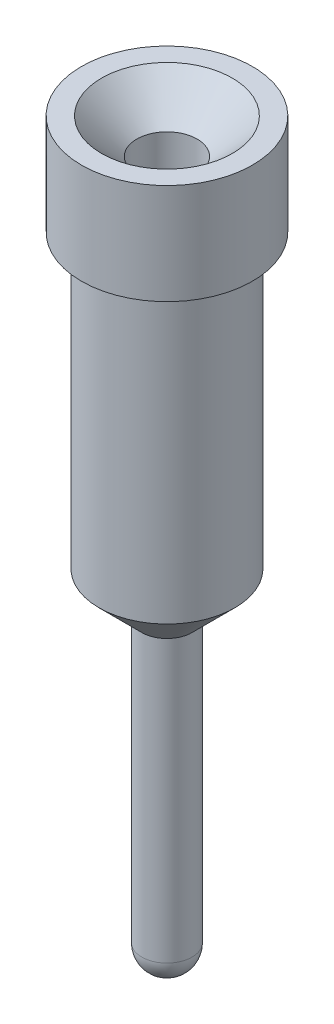
ISO-10303-21;
HEADER;
FILE_DESCRIPTION(('STEP AP214'),'2;1');
FILE_NAME('part.step','',(''),(''),'','','');
FILE_SCHEMA(('AUTOMOTIVE_DESIGN { 1 0 10303 214 1 1 1 1 }'));
ENDSEC;
DATA;
#1=APPLICATION_CONTEXT('core data for automotive mechanical design processes');
#2=APPLICATION_PROTOCOL_DEFINITION('international standard','automotive_design',2000,#1);
#3=PRODUCT_CONTEXT('',#1,'mechanical');
#4=PRODUCT('Part','Part','',(#3));
#5=PRODUCT_RELATED_PRODUCT_CATEGORY('part','',(#4));
#6=PRODUCT_DEFINITION_FORMATION('','',#4);
#7=PRODUCT_DEFINITION_CONTEXT('part definition',#1,'design');
#8=PRODUCT_DEFINITION('design','',#6,#7);
#9=PRODUCT_DEFINITION_SHAPE('','',#8);
#10=(LENGTH_UNIT() NAMED_UNIT(*) SI_UNIT(.MILLI.,.METRE.));
#11=(NAMED_UNIT(*) PLANE_ANGLE_UNIT() SI_UNIT($,.RADIAN.));
#12=(NAMED_UNIT(*) SI_UNIT($,.STERADIAN.) SOLID_ANGLE_UNIT());
#13=UNCERTAINTY_MEASURE_WITH_UNIT(LENGTH_MEASURE(1.E-05),#10,'distance_accuracy_value','');
#14=(GEOMETRIC_REPRESENTATION_CONTEXT(3) GLOBAL_UNCERTAINTY_ASSIGNED_CONTEXT((#13)) GLOBAL_UNIT_ASSIGNED_CONTEXT((#10,
#11,#12)) REPRESENTATION_CONTEXT('',''));
#15=CARTESIAN_POINT('',(0.,0.,0.));
#16=DIRECTION('',(0.,0.,1.));
#17=DIRECTION('',(1.,0.,0.));
#18=AXIS2_PLACEMENT_3D('',#15,#16,#17);
#19=CARTESIAN_POINT('',(-0.849999999999997,0.,0.));
#20=DIRECTION('',(0.,1.,0.));
#21=DIRECTION('',(0.,0.,1.));
#22=AXIS2_PLACEMENT_3D('',#19,#20,#21);
#23=PLANE('',#22);
#24=CARTESIAN_POINT('',(0.,0.,0.));
#25=DIRECTION('',(0.,1.,0.));
#26=DIRECTION('',(0.,0.,1.));
#27=AXIS2_PLACEMENT_3D('',#24,#25,#26);
#28=CIRCLE('',#27,0.849999999999997);
#29=CARTESIAN_POINT('',(0.,0.,0.849999999999997));
#30=VERTEX_POINT('',#29);
#31=EDGE_CURVE('E11',#30,#30,#28,.T.);
#32=ORIENTED_EDGE('',*,*,#31,.T.);
#33=EDGE_LOOP('',(#32));
#34=FACE_BOUND('',#33,.T.);
#35=CARTESIAN_POINT('',(0.,0.,0.));
#36=DIRECTION('',(0.,1.,0.));
#37=DIRECTION('',(0.,0.,1.));
#38=AXIS2_PLACEMENT_3D('',#35,#36,#37);
#39=CIRCLE('',#38,0.649999999999995);
#40=CARTESIAN_POINT('',(0.,0.,0.649999999999995));
#41=VERTEX_POINT('',#40);
#42=EDGE_CURVE('E73',#41,#41,#39,.T.);
#43=ORIENTED_EDGE('',*,*,#42,.F.);
#44=EDGE_LOOP('',(#43));
#45=FACE_BOUND('',#44,.T.);
#46=ADVANCED_FACE('F35',(#34,#45),#23,.T.);
#47=CARTESIAN_POINT('',(0.,28.992562867327,0.));
#48=DIRECTION('',(0.,1.,0.));
#49=DIRECTION('',(0.,0.,1.));
#50=AXIS2_PLACEMENT_3D('',#47,#48,#49);
#51=CYLINDRICAL_SURFACE('',#50,0.849999999999996);
#52=CARTESIAN_POINT('',(0.,-1.,0.));
#53=DIRECTION('',(0.,1.,0.));
#54=DIRECTION('',(0.,0.,1.));
#55=AXIS2_PLACEMENT_3D('',#52,#53,#54);
#56=CIRCLE('',#55,0.849999999999996);
#57=CARTESIAN_POINT('',(0.,-1.,0.849999999999996));
#58=VERTEX_POINT('',#57);
#59=EDGE_CURVE('E41',#58,#58,#56,.T.);
#60=ORIENTED_EDGE('',*,*,#59,.T.);
#61=EDGE_LOOP('',(#60));
#62=FACE_BOUND('',#61,.T.);
#63=ORIENTED_EDGE('',*,*,#31,.F.);
#64=EDGE_LOOP('',(#63));
#65=FACE_BOUND('',#64,.T.);
#66=ADVANCED_FACE('F62',(#62,#65),#51,.T.);
#67=CARTESIAN_POINT('',(-0.849999999999996,-0.999999999999999,0.));
#68=DIRECTION('',(0.,-1.,0.));
#69=DIRECTION('',(0.,0.,-1.));
#70=AXIS2_PLACEMENT_3D('',#67,#68,#69);
#71=PLANE('',#70);
#72=CARTESIAN_POINT('',(0.,-1.,0.));
#73=DIRECTION('',(0.,1.,0.));
#74=DIRECTION('',(0.,0.,1.));
#75=AXIS2_PLACEMENT_3D('',#72,#73,#74);
#76=CIRCLE('',#75,0.674999999999996);
#77=CARTESIAN_POINT('',(0.,-1.,0.674999999999996));
#78=VERTEX_POINT('',#77);
#79=EDGE_CURVE('E91',#78,#78,#76,.T.);
#80=ORIENTED_EDGE('',*,*,#79,.T.);
#81=EDGE_LOOP('',(#80));
#82=FACE_BOUND('',#81,.T.);
#83=ORIENTED_EDGE('',*,*,#59,.F.);
#84=EDGE_LOOP('',(#83));
#85=FACE_BOUND('',#84,.T.);
#86=ADVANCED_FACE('F67',(#82,#85),#71,.T.);
#87=CARTESIAN_POINT('',(0.,28.992562867327,0.));
#88=DIRECTION('',(0.,1.,0.));
#89=DIRECTION('',(0.,0.,1.));
#90=AXIS2_PLACEMENT_3D('',#87,#88,#89);
#91=CYLINDRICAL_SURFACE('',#90,0.674999999999996);
#92=CARTESIAN_POINT('',(0.,-3.9,0.));
#93=DIRECTION('',(0.,1.,0.));
#94=DIRECTION('',(0.,0.,1.));
#95=AXIS2_PLACEMENT_3D('',#92,#93,#94);
#96=CIRCLE('',#95,0.674999999999995);
#97=CARTESIAN_POINT('',(0.,-3.9,0.674999999999995));
#98=VERTEX_POINT('',#97);
#99=EDGE_CURVE('E88',#98,#98,#96,.T.);
#100=ORIENTED_EDGE('',*,*,#99,.T.);
#101=EDGE_LOOP('',(#100));
#102=FACE_BOUND('',#101,.T.);
#103=ORIENTED_EDGE('',*,*,#79,.F.);
#104=EDGE_LOOP('',(#103));
#105=FACE_BOUND('',#104,.T.);
#106=ADVANCED_FACE('F98',(#102,#105),#91,.T.);
#107=CARTESIAN_POINT('',(0.,-3.9,0.));
#108=DIRECTION('',(0.,1.,0.));
#109=DIRECTION('',(0.,0.,1.));
#110=AXIS2_PLACEMENT_3D('',#107,#108,#109);
#111=CONICAL_SURFACE('',#110,0.674999999999995,0.785398163397453);
#112=CARTESIAN_POINT('',(0.,-4.325,0.));
#113=DIRECTION('',(0.,1.,0.));
#114=DIRECTION('',(0.,0.,1.));
#115=AXIS2_PLACEMENT_3D('',#112,#113,#114);
#116=CIRCLE('',#115,0.249999999999996);
#117=CARTESIAN_POINT('',(0.,-4.325,0.249999999999996));
#118=VERTEX_POINT('',#117);
#119=EDGE_CURVE('E85',#118,#118,#116,.T.);
#120=ORIENTED_EDGE('',*,*,#119,.T.);
#121=EDGE_LOOP('',(#120));
#122=FACE_BOUND('',#121,.T.);
#123=ORIENTED_EDGE('',*,*,#99,.F.);
#124=EDGE_LOOP('',(#123));
#125=FACE_BOUND('',#124,.T.);
#126=ADVANCED_FACE('F104',(#122,#125),#111,.T.);
#127=CARTESIAN_POINT('',(0.,28.992562867327,0.));
#128=DIRECTION('',(0.,1.,0.));
#129=DIRECTION('',(0.,0.,1.));
#130=AXIS2_PLACEMENT_3D('',#127,#128,#129);
#131=CYLINDRICAL_SURFACE('',#130,0.249999999999996);
#132=CARTESIAN_POINT('',(0.,-7.12,0.));
#133=DIRECTION('',(0.,1.,0.));
#134=DIRECTION('',(0.,0.,1.));
#135=AXIS2_PLACEMENT_3D('',#132,#133,#134);
#136=CIRCLE('',#135,0.249999999999996);
#137=CARTESIAN_POINT('',(0.,-7.12,0.249999999999996));
#138=VERTEX_POINT('',#137);
#139=EDGE_CURVE('E82',#138,#138,#136,.T.);
#140=ORIENTED_EDGE('',*,*,#139,.T.);
#141=EDGE_LOOP('',(#140));
#142=FACE_BOUND('',#141,.T.);
#143=ORIENTED_EDGE('',*,*,#119,.F.);
#144=EDGE_LOOP('',(#143));
#145=FACE_BOUND('',#144,.T.);
#146=ADVANCED_FACE('F57',(#142,#145),#131,.T.);
#147=CARTESIAN_POINT('',(0.,-7.12,0.));
#148=DIRECTION('',(0.,1.,0.));
#149=DIRECTION('',(-1.,0.,0.));
#150=AXIS2_PLACEMENT_3D('',#147,#148,#149);
#151=SPHERICAL_SURFACE('',#150,0.249999999999996);
#152=ORIENTED_EDGE('',*,*,#139,.F.);
#153=EDGE_LOOP('',(#152));
#154=FACE_BOUND('',#153,.T.);
#155=ADVANCED_FACE('F47',(#154),#151,.T.);
#156=CARTESIAN_POINT('',(0.,-4.,0.));
#157=DIRECTION('',(0.,1.,0.));
#158=DIRECTION('',(0.,0.,1.));
#159=AXIS2_PLACEMENT_3D('',#156,#157,#158);
#160=CONICAL_SURFACE('',#159,0.,0.785398163397442);
#161=CARTESIAN_POINT('',(0.,-3.7,0.));
#162=DIRECTION('',(0.,1.,0.));
#163=DIRECTION('',(0.,0.,1.));
#164=AXIS2_PLACEMENT_3D('',#161,#162,#163);
#165=CIRCLE('',#164,0.299999999999995);
#166=CARTESIAN_POINT('',(0.,-3.7,0.299999999999995));
#167=VERTEX_POINT('',#166);
#168=EDGE_CURVE('E78',#167,#167,#165,.T.);
#169=ORIENTED_EDGE('',*,*,#168,.T.);
#170=EDGE_LOOP('',(#169));
#171=FACE_BOUND('',#170,.T.);
#172=CARTESIAN_POINT('',(0.,-4.,0.));
#173=VERTEX_POINT('',#172);
#174=VERTEX_LOOP('',#173);
#175=FACE_BOUND('',#174,.T.);
#176=ADVANCED_FACE('F44',(#171,#175),#160,.F.);
#177=CARTESIAN_POINT('',(0.,28.992562867327,0.));
#178=DIRECTION('',(0.,1.,0.));
#179=DIRECTION('',(0.,0.,1.));
#180=AXIS2_PLACEMENT_3D('',#177,#178,#179);
#181=CYLINDRICAL_SURFACE('',#180,0.299999999999996);
#182=CARTESIAN_POINT('',(0.,-0.35,0.));
#183=DIRECTION('',(0.,1.,0.));
#184=DIRECTION('',(0.,0.,1.));
#185=AXIS2_PLACEMENT_3D('',#182,#183,#184);
#186=CIRCLE('',#185,0.299999999999996);
#187=CARTESIAN_POINT('',(0.,-0.35,0.299999999999996));
#188=VERTEX_POINT('',#187);
#189=EDGE_CURVE('E75',#188,#188,#186,.T.);
#190=ORIENTED_EDGE('',*,*,#189,.T.);
#191=EDGE_LOOP('',(#190));
#192=FACE_BOUND('',#191,.T.);
#193=ORIENTED_EDGE('',*,*,#168,.F.);
#194=EDGE_LOOP('',(#193));
#195=FACE_BOUND('',#194,.T.);
#196=ADVANCED_FACE('F46',(#192,#195),#181,.F.);
#197=CARTESIAN_POINT('',(0.,-0.35,0.));
#198=DIRECTION('',(0.,1.,0.));
#199=DIRECTION('',(0.,0.,1.));
#200=AXIS2_PLACEMENT_3D('',#197,#198,#199);
#201=CONICAL_SURFACE('',#200,0.299999999999996,0.785398163397447);
#202=ORIENTED_EDGE('',*,*,#42,.T.);
#203=EDGE_LOOP('',(#202));
#204=FACE_BOUND('',#203,.T.);
#205=ORIENTED_EDGE('',*,*,#189,.F.);
#206=EDGE_LOOP('',(#205));
#207=FACE_BOUND('',#206,.T.);
#208=ADVANCED_FACE('F54',(#204,#207),#201,.F.);
#209=CLOSED_SHELL('',(#46,#66,#86,#106,#126,#146,#155,#176,#196,#208));
#210=MANIFOLD_SOLID_BREP('B2',#209);
#211=ADVANCED_BREP_SHAPE_REPRESENTATION('',(#18,#210),#14);
#212=SHAPE_DEFINITION_REPRESENTATION(#9,#211);
ENDSEC;
END-ISO-10303-21;
